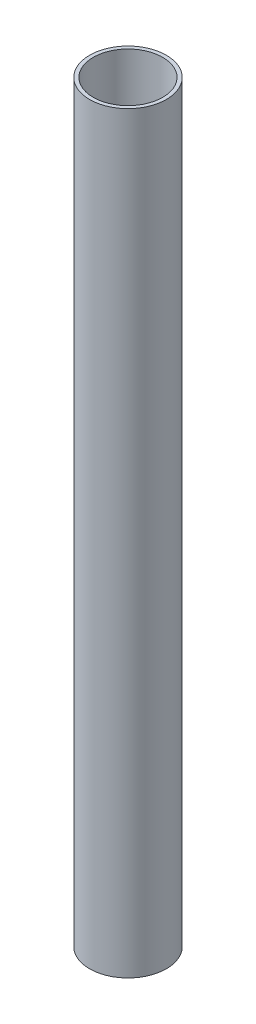
ISO-10303-21;
HEADER;
FILE_DESCRIPTION(('STEP AP214'),'2;1');
FILE_NAME('part.step','',(''),(''),'','','');
FILE_SCHEMA(('AUTOMOTIVE_DESIGN { 1 0 10303 214 1 1 1 1 }'));
ENDSEC;
DATA;
#1=APPLICATION_CONTEXT('core data for automotive mechanical design processes');
#2=APPLICATION_PROTOCOL_DEFINITION('international standard','automotive_design',2000,#1);
#3=PRODUCT_CONTEXT('',#1,'mechanical');
#4=PRODUCT('Part','Part','',(#3));
#5=PRODUCT_RELATED_PRODUCT_CATEGORY('part','',(#4));
#6=PRODUCT_DEFINITION_FORMATION('','',#4);
#7=PRODUCT_DEFINITION_CONTEXT('part definition',#1,'design');
#8=PRODUCT_DEFINITION('design','',#6,#7);
#9=PRODUCT_DEFINITION_SHAPE('','',#8);
#10=(LENGTH_UNIT() NAMED_UNIT(*) SI_UNIT(.MILLI.,.METRE.));
#11=(NAMED_UNIT(*) PLANE_ANGLE_UNIT() SI_UNIT($,.RADIAN.));
#12=(NAMED_UNIT(*) SI_UNIT($,.STERADIAN.) SOLID_ANGLE_UNIT());
#13=UNCERTAINTY_MEASURE_WITH_UNIT(LENGTH_MEASURE(1.E-05),#10,'distance_accuracy_value','');
#14=(GEOMETRIC_REPRESENTATION_CONTEXT(3) GLOBAL_UNCERTAINTY_ASSIGNED_CONTEXT((#13)) GLOBAL_UNIT_ASSIGNED_CONTEXT((#10,
#11,#12)) REPRESENTATION_CONTEXT('',''));
#15=CARTESIAN_POINT('',(0.,0.,0.));
#16=DIRECTION('',(0.,0.,1.));
#17=DIRECTION('',(1.,0.,0.));
#18=AXIS2_PLACEMENT_3D('',#15,#16,#17);
#19=CARTESIAN_POINT('',(0.,412.,0.));
#20=DIRECTION('',(0.,1.,0.));
#21=DIRECTION('',(0.,0.,1.));
#22=AXIS2_PLACEMENT_3D('',#19,#20,#21);
#23=PLANE('',#22);
#24=CARTESIAN_POINT('',(0.,412.,0.));
#25=DIRECTION('',(0.,1.,0.));
#26=DIRECTION('',(0.,0.,1.));
#27=AXIS2_PLACEMENT_3D('',#24,#25,#26);
#28=CIRCLE('',#27,21.);
#29=CARTESIAN_POINT('',(0.,412.,21.));
#30=VERTEX_POINT('',#29);
#31=EDGE_CURVE('E10',#30,#30,#28,.T.);
#32=ORIENTED_EDGE('',*,*,#31,.T.);
#33=EDGE_LOOP('',(#32));
#34=FACE_BOUND('',#33,.T.);
#35=CARTESIAN_POINT('',(0.,412.,0.));
#36=DIRECTION('',(0.,1.,0.));
#37=DIRECTION('',(0.,0.,1.));
#38=AXIS2_PLACEMENT_3D('',#35,#36,#37);
#39=CIRCLE('',#38,19.);
#40=CARTESIAN_POINT('',(0.,412.,19.));
#41=VERTEX_POINT('',#40);
#42=EDGE_CURVE('E50',#41,#41,#39,.T.);
#43=ORIENTED_EDGE('',*,*,#42,.F.);
#44=EDGE_LOOP('',(#43));
#45=FACE_BOUND('',#44,.T.);
#46=ADVANCED_FACE('F37',(#34,#45),#23,.T.);
#47=CARTESIAN_POINT('',(0.,0.,0.));
#48=DIRECTION('',(0.,1.,0.));
#49=DIRECTION('',(0.,0.,1.));
#50=AXIS2_PLACEMENT_3D('',#47,#48,#49);
#51=PLANE('',#50);
#52=CARTESIAN_POINT('',(0.,0.,0.));
#53=DIRECTION('',(0.,1.,0.));
#54=DIRECTION('',(0.,0.,1.));
#55=AXIS2_PLACEMENT_3D('',#52,#53,#54);
#56=CIRCLE('',#55,21.);
#57=CARTESIAN_POINT('',(0.,0.,21.));
#58=VERTEX_POINT('',#57);
#59=EDGE_CURVE('E41',#58,#58,#56,.T.);
#60=ORIENTED_EDGE('',*,*,#59,.F.);
#61=EDGE_LOOP('',(#60));
#62=FACE_BOUND('',#61,.T.);
#63=CARTESIAN_POINT('',(0.,0.,0.));
#64=DIRECTION('',(0.,1.,0.));
#65=DIRECTION('',(0.,0.,1.));
#66=AXIS2_PLACEMENT_3D('',#63,#64,#65);
#67=CIRCLE('',#66,19.);
#68=CARTESIAN_POINT('',(0.,0.,19.));
#69=VERTEX_POINT('',#68);
#70=EDGE_CURVE('E52',#69,#69,#67,.T.);
#71=ORIENTED_EDGE('',*,*,#70,.T.);
#72=EDGE_LOOP('',(#71));
#73=FACE_BOUND('',#72,.T.);
#74=ADVANCED_FACE('F64',(#62,#73),#51,.F.);
#75=CARTESIAN_POINT('',(0.,412.,0.));
#76=DIRECTION('',(0.,-1.,0.));
#77=DIRECTION('',(0.,0.,-1.));
#78=AXIS2_PLACEMENT_3D('',#75,#76,#77);
#79=CYLINDRICAL_SURFACE('',#78,21.);
#80=ORIENTED_EDGE('',*,*,#31,.F.);
#81=EDGE_LOOP('',(#80));
#82=FACE_BOUND('',#81,.T.);
#83=ORIENTED_EDGE('',*,*,#59,.T.);
#84=EDGE_LOOP('',(#83));
#85=FACE_BOUND('',#84,.T.);
#86=ADVANCED_FACE('F39',(#82,#85),#79,.T.);
#87=CARTESIAN_POINT('',(0.,412.,0.));
#88=DIRECTION('',(0.,-1.,0.));
#89=DIRECTION('',(0.,0.,-1.));
#90=AXIS2_PLACEMENT_3D('',#87,#88,#89);
#91=CYLINDRICAL_SURFACE('',#90,19.);
#92=ORIENTED_EDGE('',*,*,#42,.T.);
#93=EDGE_LOOP('',(#92));
#94=FACE_BOUND('',#93,.T.);
#95=ORIENTED_EDGE('',*,*,#70,.F.);
#96=EDGE_LOOP('',(#95));
#97=FACE_BOUND('',#96,.T.);
#98=ADVANCED_FACE('F60',(#94,#97),#91,.F.);
#99=CLOSED_SHELL('',(#46,#74,#86,#98));
#100=MANIFOLD_SOLID_BREP('B2',#99);
#101=ADVANCED_BREP_SHAPE_REPRESENTATION('',(#18,#100),#14);
#102=SHAPE_DEFINITION_REPRESENTATION(#9,#101);
ENDSEC;
END-ISO-10303-21;
